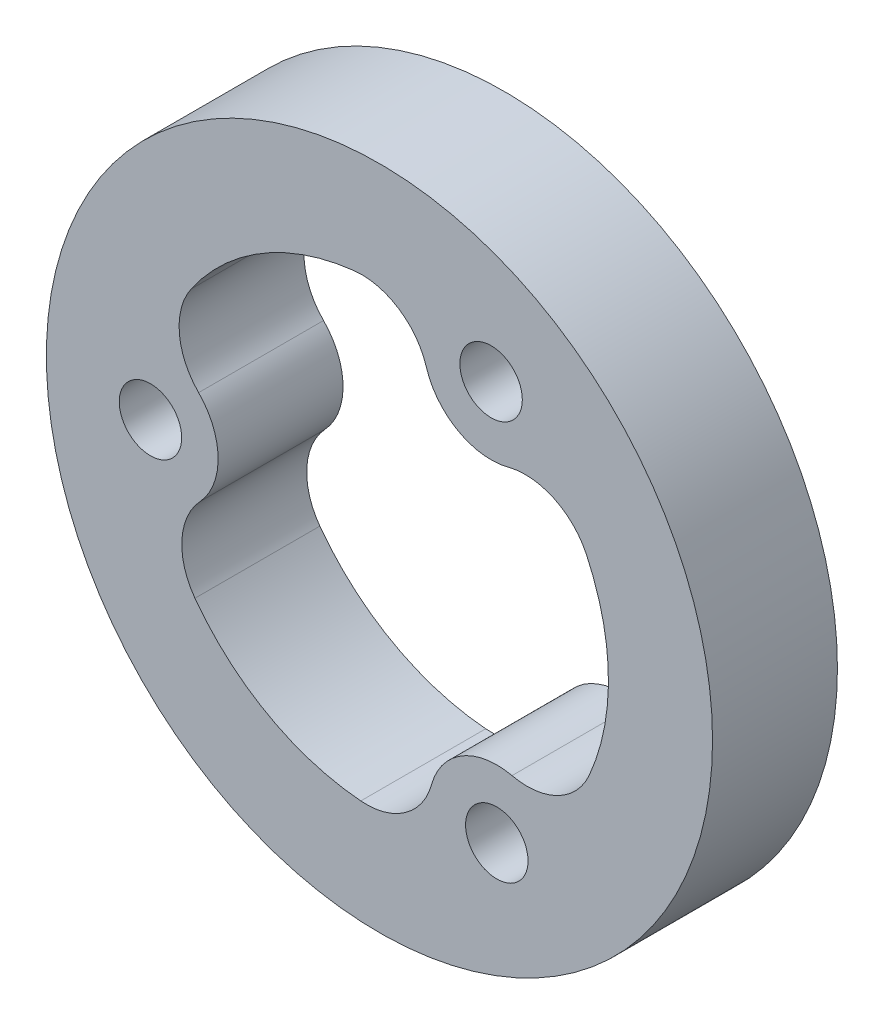
ISO-10303-21;
HEADER;
FILE_DESCRIPTION(('STEP AP214'),'2;1');
FILE_NAME('part.step','',(''),(''),'','','');
FILE_SCHEMA(('AUTOMOTIVE_DESIGN { 1 0 10303 214 1 1 1 1 }'));
ENDSEC;
DATA;
#1=APPLICATION_CONTEXT('core data for automotive mechanical design processes');
#2=APPLICATION_PROTOCOL_DEFINITION('international standard','automotive_design',2000,#1);
#3=PRODUCT_CONTEXT('',#1,'mechanical');
#4=PRODUCT('Part','Part','',(#3));
#5=PRODUCT_RELATED_PRODUCT_CATEGORY('part','',(#4));
#6=PRODUCT_DEFINITION_FORMATION('','',#4);
#7=PRODUCT_DEFINITION_CONTEXT('part definition',#1,'design');
#8=PRODUCT_DEFINITION('design','',#6,#7);
#9=PRODUCT_DEFINITION_SHAPE('','',#8);
#10=(LENGTH_UNIT() NAMED_UNIT(*) SI_UNIT(.MILLI.,.METRE.));
#11=(NAMED_UNIT(*) PLANE_ANGLE_UNIT() SI_UNIT($,.RADIAN.));
#12=(NAMED_UNIT(*) SI_UNIT($,.STERADIAN.) SOLID_ANGLE_UNIT());
#13=UNCERTAINTY_MEASURE_WITH_UNIT(LENGTH_MEASURE(1.E-05),#10,'distance_accuracy_value','');
#14=(GEOMETRIC_REPRESENTATION_CONTEXT(3) GLOBAL_UNCERTAINTY_ASSIGNED_CONTEXT((#13)) GLOBAL_UNIT_ASSIGNED_CONTEXT((#10,
#11,#12)) REPRESENTATION_CONTEXT('',''));
#15=CARTESIAN_POINT('',(0.,0.,0.));
#16=DIRECTION('',(0.,0.,1.));
#17=DIRECTION('',(1.,0.,0.));
#18=AXIS2_PLACEMENT_3D('',#15,#16,#17);
#19=CARTESIAN_POINT('',(0.,0.,6.));
#20=DIRECTION('',(0.,0.,1.));
#21=DIRECTION('',(1.,0.,0.));
#22=AXIS2_PLACEMENT_3D('',#19,#20,#21);
#23=PLANE('',#22);
#24=CARTESIAN_POINT('',(5.36232428206938,9.60445096264857,6.));
#25=DIRECTION('',(0.,0.,1.));
#26=DIRECTION('',(1.,0.,0.));
#27=AXIS2_PLACEMENT_3D('',#24,#25,#26);
#28=CIRCLE('',#27,1.49999999999965);
#29=CARTESIAN_POINT('',(6.86232428206902,9.60445096264857,6.));
#30=VERTEX_POINT('',#29);
#31=EDGE_CURVE('E403',#30,#30,#28,.T.);
#32=ORIENTED_EDGE('',*,*,#31,.F.);
#33=EDGE_LOOP('',(#32));
#34=FACE_BOUND('',#33,.T.);
#35=CARTESIAN_POINT('',(-10.9988606640904,-0.158316429722264,6.));
#36=DIRECTION('',(0.,0.,-1.));
#37=DIRECTION('',(1.,0.,0.));
#38=AXIS2_PLACEMENT_3D('',#35,#36,#37);
#39=CIRCLE('',#38,3.24999999999999);
#40=CARTESIAN_POINT('',(-8.6863165804043,2.12524216619956,6.));
#41=VERTEX_POINT('',#40);
#42=CARTESIAN_POINT('',(-8.6215496453974,-2.37436975047086,6.));
#43=VERTEX_POINT('',#42);
#44=EDGE_CURVE('E130',#41,#43,#39,.T.);
#45=ORIENTED_EDGE('',*,*,#44,.F.);
#46=CARTESIAN_POINT('',(-6.37377249671819,4.40880076212158,6.));
#47=DIRECTION('',(0.,0.,1.));
#48=DIRECTION('',(1.,0.,0.));
#49=AXIS2_PLACEMENT_3D('',#46,#47,#48);
#50=CIRCLE('',#49,3.24999999999926);
#51=CARTESIAN_POINT('',(-9.04664483405021,6.25765269462329,6.));
#52=VERTEX_POINT('',#51);
#53=EDGE_CURVE('E122',#52,#41,#50,.T.);
#54=ORIENTED_EDGE('',*,*,#53,.F.);
#55=CARTESIAN_POINT('',(0.,0.,6.));
#56=DIRECTION('',(0.,0.,1.));
#57=DIRECTION('',(1.,0.,0.));
#58=AXIS2_PLACEMENT_3D('',#55,#56,#57);
#59=CIRCLE('',#58,10.9999999999988);
#60=CARTESIAN_POINT('',(-1.2111407077235,10.9331211548244,6.));
#61=VERTEX_POINT('',#60);
#62=EDGE_CURVE('E164',#61,#52,#59,.T.);
#63=ORIENTED_EDGE('',*,*,#62,.F.);
#64=CARTESIAN_POINT('',(-0.85330368044189,7.70288081362794,6.));
#65=DIRECTION('',(0.,0.,1.));
#66=DIRECTION('',(1.,0.,0.));
#67=AXIS2_PLACEMENT_3D('',#64,#65,#66);
#68=CIRCLE('',#67,3.24999999999908);
#69=CARTESIAN_POINT('',(2.25451030081381,8.65366588813813,6.));
#70=VERTEX_POINT('',#69);
#71=EDGE_CURVE('E162',#70,#61,#68,.T.);
#72=ORIENTED_EDGE('',*,*,#71,.F.);
#73=CARTESIAN_POINT('',(5.36232428206938,9.60445096264857,6.));
#74=DIRECTION('',(0.,0.,-1.));
#75=DIRECTION('',(1.,0.,0.));
#76=AXIS2_PLACEMENT_3D('',#73,#74,#75);
#77=CIRCLE('',#76,3.24999999999991);
#78=CARTESIAN_POINT('',(6.18367199532531,6.45994974084337,6.));
#79=VERTEX_POINT('',#78);
#80=EDGE_CURVE('E160',#79,#70,#77,.T.);
#81=ORIENTED_EDGE('',*,*,#80,.F.);
#82=CARTESIAN_POINT('',(7.00501970858067,3.31544851903942,6.));
#83=DIRECTION('',(0.,0.,1.));
#84=DIRECTION('',(1.,0.,0.));
#85=AXIS2_PLACEMENT_3D('',#82,#83,#84);
#86=CIRCLE('',#85,3.24999999999943);
#87=CARTESIAN_POINT('',(9.94260861862918,4.70579789799105,6.));
#88=VERTEX_POINT('',#87);
#89=EDGE_CURVE('E158',#88,#79,#86,.T.);
#90=ORIENTED_EDGE('',*,*,#89,.F.);
#91=CARTESIAN_POINT('',(0.,0.,6.));
#92=DIRECTION('',(0.,0.,1.));
#93=DIRECTION('',(1.,0.,0.));
#94=AXIS2_PLACEMENT_3D('',#91,#92,#93);
#95=CIRCLE('',#94,10.9999999999989);
#96=CARTESIAN_POINT('',(10.0739310165937,-4.41768195696649,6.));
#97=VERTEX_POINT('',#96);
#98=EDGE_CURVE('E156',#97,#88,#95,.T.);
#99=ORIENTED_EDGE('',*,*,#98,.F.);
#100=CARTESIAN_POINT('',(7.09754230714633,-3.11245774240856,6.));
#101=DIRECTION('',(0.,0.,1.));
#102=DIRECTION('',(1.,0.,0.));
#103=AXIS2_PLACEMENT_3D('',#100,#101,#102);
#104=CIRCLE('',#103,3.24999999999907);
#105=CARTESIAN_POINT('',(6.36703934458366,-6.27929613766765,6.));
#106=VERTEX_POINT('',#105);
#107=EDGE_CURVE('E154',#106,#97,#104,.T.);
#108=ORIENTED_EDGE('',*,*,#107,.F.);
#109=CARTESIAN_POINT('',(5.636536382021,-9.44613453292673,6.));
#110=DIRECTION('',(0.,0.,-1.));
#111=DIRECTION('',(1.,0.,0.));
#112=AXIS2_PLACEMENT_3D('',#109,#110,#111);
#113=CIRCLE('',#112,3.24999999999999);
#114=CARTESIAN_POINT('',(2.50264458507853,-8.58519190704386,6.));
#115=VERTEX_POINT('',#114);
#116=EDGE_CURVE('E152',#115,#106,#113,.T.);
#117=ORIENTED_EDGE('',*,*,#116,.F.);
#118=CARTESIAN_POINT('',(-0.631247211862512,-7.72424928116139,6.));
#119=DIRECTION('',(0.,0.,1.));
#120=DIRECTION('',(1.,0.,0.));
#121=AXIS2_PLACEMENT_3D('',#118,#119,#120);
#122=CIRCLE('',#121,3.24999999999935);
#123=CARTESIAN_POINT('',(-0.895963784578909,-10.9634505926145,6.));
#124=VERTEX_POINT('',#123);
#125=EDGE_CURVE('E150',#124,#115,#122,.T.);
#126=ORIENTED_EDGE('',*,*,#125,.F.);
#127=CARTESIAN_POINT('',(0.,0.,6.));
#128=DIRECTION('',(0.,0.,1.));
#129=DIRECTION('',(1.,0.,0.));
#130=AXIS2_PLACEMENT_3D('',#127,#128,#129);
#131=CIRCLE('',#130,10.9999999999989);
#132=CARTESIAN_POINT('',(-8.86279030886989,-6.51543919785902,6.));
#133=VERTEX_POINT('',#132);
#134=EDGE_CURVE('E145',#133,#124,#131,.T.);
#135=ORIENTED_EDGE('',*,*,#134,.F.);
#136=CARTESIAN_POINT('',(-6.24423862670442,-4.59042307121947,6.));
#137=DIRECTION('',(0.,0.,1.));
#138=DIRECTION('',(1.,0.,0.));
#139=AXIS2_PLACEMENT_3D('',#136,#137,#138);
#140=CIRCLE('',#139,3.24999999999907);
#141=EDGE_CURVE('E143',#43,#133,#140,.T.);
#142=ORIENTED_EDGE('',*,*,#141,.F.);
#143=EDGE_LOOP('',(#45,#54,#63,#72,#81,#90,#99,#108,#117,#126,#135,#142));
#144=FACE_BOUND('',#143,.T.);
#145=CARTESIAN_POINT('',(0.,0.,6.));
#146=DIRECTION('',(0.,0.,1.));
#147=DIRECTION('',(1.,0.,0.));
#148=AXIS2_PLACEMENT_3D('',#145,#146,#147);
#149=CIRCLE('',#148,16.);
#150=CARTESIAN_POINT('',(16.,0.,6.));
#151=VERTEX_POINT('',#150);
#152=EDGE_CURVE('E11',#151,#151,#149,.T.);
#153=ORIENTED_EDGE('',*,*,#152,.T.);
#154=EDGE_LOOP('',(#153));
#155=FACE_BOUND('',#154,.T.);
#156=CARTESIAN_POINT('',(-10.9988606640904,-0.158316429722264,6.));
#157=DIRECTION('',(0.,0.,1.));
#158=DIRECTION('',(1.,0.,0.));
#159=AXIS2_PLACEMENT_3D('',#156,#157,#158);
#160=CIRCLE('',#159,1.49999999999981);
#161=CARTESIAN_POINT('',(-9.49886066409057,-0.158316429722264,6.));
#162=VERTEX_POINT('',#161);
#163=EDGE_CURVE('E167',#162,#162,#160,.T.);
#164=ORIENTED_EDGE('',*,*,#163,.F.);
#165=EDGE_LOOP('',(#164));
#166=FACE_BOUND('',#165,.T.);
#167=CARTESIAN_POINT('',(5.636536382021,-9.44613453292673,6.));
#168=DIRECTION('',(0.,0.,1.));
#169=DIRECTION('',(1.,0.,0.));
#170=AXIS2_PLACEMENT_3D('',#167,#168,#169);
#171=CIRCLE('',#170,1.49999999999988);
#172=CARTESIAN_POINT('',(7.13653638202088,-9.44613453292673,6.));
#173=VERTEX_POINT('',#172);
#174=EDGE_CURVE('E394',#173,#173,#171,.T.);
#175=ORIENTED_EDGE('',*,*,#174,.F.);
#176=EDGE_LOOP('',(#175));
#177=FACE_BOUND('',#176,.T.);
#178=ADVANCED_FACE('F33',(#34,#144,#155,#166,#177),#23,.T.);
#179=CARTESIAN_POINT('',(0.,0.,0.));
#180=DIRECTION('',(0.,0.,1.));
#181=DIRECTION('',(1.,0.,0.));
#182=AXIS2_PLACEMENT_3D('',#179,#180,#181);
#183=PLANE('',#182);
#184=CARTESIAN_POINT('',(0.,0.,0.));
#185=DIRECTION('',(0.,0.,1.));
#186=DIRECTION('',(1.,0.,0.));
#187=AXIS2_PLACEMENT_3D('',#184,#185,#186);
#188=CIRCLE('',#187,16.);
#189=CARTESIAN_POINT('',(16.,0.,0.));
#190=VERTEX_POINT('',#189);
#191=EDGE_CURVE('E37',#190,#190,#188,.T.);
#192=ORIENTED_EDGE('',*,*,#191,.F.);
#193=EDGE_LOOP('',(#192));
#194=FACE_BOUND('',#193,.T.);
#195=CARTESIAN_POINT('',(-6.37377249671819,4.40880076212158,0.));
#196=DIRECTION('',(0.,0.,1.));
#197=DIRECTION('',(1.,0.,0.));
#198=AXIS2_PLACEMENT_3D('',#195,#196,#197);
#199=CIRCLE('',#198,3.24999999999926);
#200=CARTESIAN_POINT('',(-9.04664483405021,6.25765269462329,0.));
#201=VERTEX_POINT('',#200);
#202=CARTESIAN_POINT('',(-8.6863165804043,2.12524216619956,0.));
#203=VERTEX_POINT('',#202);
#204=EDGE_CURVE('E56',#201,#203,#199,.T.);
#205=ORIENTED_EDGE('',*,*,#204,.T.);
#206=CARTESIAN_POINT('',(-10.9988606640904,-0.158316429722264,0.));
#207=DIRECTION('',(0.,0.,-1.));
#208=DIRECTION('',(1.,0.,0.));
#209=AXIS2_PLACEMENT_3D('',#206,#207,#208);
#210=CIRCLE('',#209,3.24999999999999);
#211=CARTESIAN_POINT('',(-8.6215496453974,-2.37436975047086,0.));
#212=VERTEX_POINT('',#211);
#213=EDGE_CURVE('E137',#203,#212,#210,.T.);
#214=ORIENTED_EDGE('',*,*,#213,.T.);
#215=CARTESIAN_POINT('',(-6.24423862670442,-4.59042307121947,0.));
#216=DIRECTION('',(0.,0.,1.));
#217=DIRECTION('',(1.,0.,0.));
#218=AXIS2_PLACEMENT_3D('',#215,#216,#217);
#219=CIRCLE('',#218,3.24999999999907);
#220=CARTESIAN_POINT('',(-8.86279030886989,-6.51543919785902,0.));
#221=VERTEX_POINT('',#220);
#222=EDGE_CURVE('E169',#212,#221,#219,.T.);
#223=ORIENTED_EDGE('',*,*,#222,.T.);
#224=CARTESIAN_POINT('',(0.,0.,0.));
#225=DIRECTION('',(0.,0.,1.));
#226=DIRECTION('',(1.,0.,0.));
#227=AXIS2_PLACEMENT_3D('',#224,#225,#226);
#228=CIRCLE('',#227,10.9999999999989);
#229=CARTESIAN_POINT('',(-0.895963784578909,-10.9634505926145,0.));
#230=VERTEX_POINT('',#229);
#231=EDGE_CURVE('E172',#221,#230,#228,.T.);
#232=ORIENTED_EDGE('',*,*,#231,.T.);
#233=CARTESIAN_POINT('',(-0.631247211862512,-7.72424928116139,0.));
#234=DIRECTION('',(0.,0.,1.));
#235=DIRECTION('',(1.,0.,0.));
#236=AXIS2_PLACEMENT_3D('',#233,#234,#235);
#237=CIRCLE('',#236,3.24999999999935);
#238=CARTESIAN_POINT('',(2.50264458507853,-8.58519190704386,0.));
#239=VERTEX_POINT('',#238);
#240=EDGE_CURVE('E175',#230,#239,#237,.T.);
#241=ORIENTED_EDGE('',*,*,#240,.T.);
#242=CARTESIAN_POINT('',(5.636536382021,-9.44613453292673,0.));
#243=DIRECTION('',(0.,0.,-1.));
#244=DIRECTION('',(1.,0.,0.));
#245=AXIS2_PLACEMENT_3D('',#242,#243,#244);
#246=CIRCLE('',#245,3.24999999999999);
#247=CARTESIAN_POINT('',(6.36703934458366,-6.27929613766765,0.));
#248=VERTEX_POINT('',#247);
#249=EDGE_CURVE('E178',#239,#248,#246,.T.);
#250=ORIENTED_EDGE('',*,*,#249,.T.);
#251=CARTESIAN_POINT('',(7.09754230714633,-3.11245774240856,0.));
#252=DIRECTION('',(0.,0.,1.));
#253=DIRECTION('',(1.,0.,0.));
#254=AXIS2_PLACEMENT_3D('',#251,#252,#253);
#255=CIRCLE('',#254,3.24999999999907);
#256=CARTESIAN_POINT('',(10.0739310165937,-4.41768195696649,0.));
#257=VERTEX_POINT('',#256);
#258=EDGE_CURVE('E181',#248,#257,#255,.T.);
#259=ORIENTED_EDGE('',*,*,#258,.T.);
#260=CARTESIAN_POINT('',(0.,0.,0.));
#261=DIRECTION('',(0.,0.,1.));
#262=DIRECTION('',(1.,0.,0.));
#263=AXIS2_PLACEMENT_3D('',#260,#261,#262);
#264=CIRCLE('',#263,10.9999999999989);
#265=CARTESIAN_POINT('',(9.94260861862918,4.70579789799105,0.));
#266=VERTEX_POINT('',#265);
#267=EDGE_CURVE('E184',#257,#266,#264,.T.);
#268=ORIENTED_EDGE('',*,*,#267,.T.);
#269=CARTESIAN_POINT('',(7.00501970858067,3.31544851903942,0.));
#270=DIRECTION('',(0.,0.,1.));
#271=DIRECTION('',(1.,0.,0.));
#272=AXIS2_PLACEMENT_3D('',#269,#270,#271);
#273=CIRCLE('',#272,3.24999999999943);
#274=CARTESIAN_POINT('',(6.18367199532531,6.45994974084337,0.));
#275=VERTEX_POINT('',#274);
#276=EDGE_CURVE('E187',#266,#275,#273,.T.);
#277=ORIENTED_EDGE('',*,*,#276,.T.);
#278=CARTESIAN_POINT('',(5.36232428206938,9.60445096264857,0.));
#279=DIRECTION('',(0.,0.,-1.));
#280=DIRECTION('',(1.,0.,0.));
#281=AXIS2_PLACEMENT_3D('',#278,#279,#280);
#282=CIRCLE('',#281,3.24999999999991);
#283=CARTESIAN_POINT('',(2.25451030081381,8.65366588813813,0.));
#284=VERTEX_POINT('',#283);
#285=EDGE_CURVE('E190',#275,#284,#282,.T.);
#286=ORIENTED_EDGE('',*,*,#285,.T.);
#287=CARTESIAN_POINT('',(-0.85330368044189,7.70288081362794,0.));
#288=DIRECTION('',(0.,0.,1.));
#289=DIRECTION('',(1.,0.,0.));
#290=AXIS2_PLACEMENT_3D('',#287,#288,#289);
#291=CIRCLE('',#290,3.24999999999908);
#292=CARTESIAN_POINT('',(-1.21114070772362,10.9331211548255,0.));
#293=VERTEX_POINT('',#292);
#294=EDGE_CURVE('E193',#284,#293,#291,.T.);
#295=ORIENTED_EDGE('',*,*,#294,.T.);
#296=CARTESIAN_POINT('',(0.,0.,0.));
#297=DIRECTION('',(0.,0.,1.));
#298=DIRECTION('',(1.,0.,0.));
#299=AXIS2_PLACEMENT_3D('',#296,#297,#298);
#300=CIRCLE('',#299,10.9999999999988);
#301=EDGE_CURVE('E131',#293,#201,#300,.T.);
#302=ORIENTED_EDGE('',*,*,#301,.T.);
#303=EDGE_LOOP('',(#205,#214,#223,#232,#241,#250,#259,#268,#277,#286,#295,#302));
#304=FACE_BOUND('',#303,.T.);
#305=CARTESIAN_POINT('',(-10.9988606640904,-0.158316429722264,0.));
#306=DIRECTION('',(0.,0.,1.));
#307=DIRECTION('',(1.,0.,0.));
#308=AXIS2_PLACEMENT_3D('',#305,#306,#307);
#309=CIRCLE('',#308,1.49999999999981);
#310=CARTESIAN_POINT('',(-9.49886066409057,-0.158316429722264,0.));
#311=VERTEX_POINT('',#310);
#312=EDGE_CURVE('E406',#311,#311,#309,.T.);
#313=ORIENTED_EDGE('',*,*,#312,.T.);
#314=EDGE_LOOP('',(#313));
#315=FACE_BOUND('',#314,.T.);
#316=CARTESIAN_POINT('',(5.36232428206938,9.60445096264857,0.));
#317=DIRECTION('',(0.,0.,1.));
#318=DIRECTION('',(1.,0.,0.));
#319=AXIS2_PLACEMENT_3D('',#316,#317,#318);
#320=CIRCLE('',#319,1.49999999999965);
#321=CARTESIAN_POINT('',(6.86232428206902,9.60445096264857,0.));
#322=VERTEX_POINT('',#321);
#323=EDGE_CURVE('E400',#322,#322,#320,.T.);
#324=ORIENTED_EDGE('',*,*,#323,.T.);
#325=EDGE_LOOP('',(#324));
#326=FACE_BOUND('',#325,.T.);
#327=CARTESIAN_POINT('',(5.636536382021,-9.44613453292673,0.));
#328=DIRECTION('',(0.,0.,1.));
#329=DIRECTION('',(1.,0.,0.));
#330=AXIS2_PLACEMENT_3D('',#327,#328,#329);
#331=CIRCLE('',#330,1.49999999999988);
#332=CARTESIAN_POINT('',(7.13653638202088,-9.44613453292673,0.));
#333=VERTEX_POINT('',#332);
#334=EDGE_CURVE('E397',#333,#333,#331,.T.);
#335=ORIENTED_EDGE('',*,*,#334,.T.);
#336=EDGE_LOOP('',(#335));
#337=FACE_BOUND('',#336,.T.);
#338=ADVANCED_FACE('F222',(#194,#304,#315,#326,#337),#183,.F.);
#339=CARTESIAN_POINT('',(0.,0.,6.));
#340=DIRECTION('',(0.,0.,-1.));
#341=DIRECTION('',(-1.,0.,0.));
#342=AXIS2_PLACEMENT_3D('',#339,#340,#341);
#343=CYLINDRICAL_SURFACE('',#342,16.);
#344=ORIENTED_EDGE('',*,*,#152,.F.);
#345=EDGE_LOOP('',(#344));
#346=FACE_BOUND('',#345,.T.);
#347=ORIENTED_EDGE('',*,*,#191,.T.);
#348=EDGE_LOOP('',(#347));
#349=FACE_BOUND('',#348,.T.);
#350=ADVANCED_FACE('F35',(#346,#349),#343,.T.);
#351=CARTESIAN_POINT('',(-6.37377249671819,4.40880076212158,6.));
#352=DIRECTION('',(0.,0.,-1.));
#353=DIRECTION('',(-1.,0.,0.));
#354=AXIS2_PLACEMENT_3D('',#351,#352,#353);
#355=CYLINDRICAL_SURFACE('',#354,3.24999999999926);
#356=ORIENTED_EDGE('',*,*,#204,.F.);
#357=DIRECTION('',(0.,0.,-1.));
#358=VECTOR('',#357,1.);
#359=CARTESIAN_POINT('',(-9.04664483405021,6.25765269462329,6.));
#360=LINE('',#359,#358);
#361=EDGE_CURVE('E126',#52,#201,#360,.T.);
#362=ORIENTED_EDGE('',*,*,#361,.F.);
#363=ORIENTED_EDGE('',*,*,#53,.T.);
#364=DIRECTION('',(0.,0.,-1.));
#365=VECTOR('',#364,1.);
#366=CARTESIAN_POINT('',(-8.6863165804043,2.12524216619956,6.));
#367=LINE('',#366,#365);
#368=EDGE_CURVE('E125',#41,#203,#367,.T.);
#369=ORIENTED_EDGE('',*,*,#368,.T.);
#370=EDGE_LOOP('',(#356,#362,#363,#369));
#371=FACE_BOUND('',#370,.T.);
#372=ADVANCED_FACE('F124',(#371),#355,.F.);
#373=CARTESIAN_POINT('',(-10.9988606640904,-0.158316429722264,6.));
#374=DIRECTION('',(0.,0.,-1.));
#375=DIRECTION('',(-1.,0.,0.));
#376=AXIS2_PLACEMENT_3D('',#373,#374,#375);
#377=CYLINDRICAL_SURFACE('',#376,3.24999999999999);
#378=ORIENTED_EDGE('',*,*,#213,.F.);
#379=ORIENTED_EDGE('',*,*,#368,.F.);
#380=ORIENTED_EDGE('',*,*,#44,.T.);
#381=DIRECTION('',(0.,0.,-1.));
#382=VECTOR('',#381,1.);
#383=CARTESIAN_POINT('',(-8.6215496453974,-2.37436975047086,6.));
#384=LINE('',#383,#382);
#385=EDGE_CURVE('E138',#43,#212,#384,.T.);
#386=ORIENTED_EDGE('',*,*,#385,.T.);
#387=EDGE_LOOP('',(#378,#379,#380,#386));
#388=FACE_BOUND('',#387,.T.);
#389=ADVANCED_FACE('F134',(#388),#377,.T.);
#390=CARTESIAN_POINT('',(-6.24423862670442,-4.59042307121947,6.));
#391=DIRECTION('',(0.,0.,-1.));
#392=DIRECTION('',(-1.,0.,0.));
#393=AXIS2_PLACEMENT_3D('',#390,#391,#392);
#394=CYLINDRICAL_SURFACE('',#393,3.24999999999907);
#395=ORIENTED_EDGE('',*,*,#222,.F.);
#396=ORIENTED_EDGE('',*,*,#385,.F.);
#397=ORIENTED_EDGE('',*,*,#141,.T.);
#398=DIRECTION('',(0.,0.,-1.));
#399=VECTOR('',#398,1.);
#400=CARTESIAN_POINT('',(-8.86279030886989,-6.51543919785902,6.));
#401=LINE('',#400,#399);
#402=EDGE_CURVE('E214',#133,#221,#401,.T.);
#403=ORIENTED_EDGE('',*,*,#402,.T.);
#404=EDGE_LOOP('',(#395,#396,#397,#403));
#405=FACE_BOUND('',#404,.T.);
#406=ADVANCED_FACE('F218',(#405),#394,.F.);
#407=CARTESIAN_POINT('',(0.,0.,6.));
#408=DIRECTION('',(0.,0.,-1.));
#409=DIRECTION('',(-1.,0.,0.));
#410=AXIS2_PLACEMENT_3D('',#407,#408,#409);
#411=CYLINDRICAL_SURFACE('',#410,10.9999999999989);
#412=ORIENTED_EDGE('',*,*,#231,.F.);
#413=ORIENTED_EDGE('',*,*,#402,.F.);
#414=ORIENTED_EDGE('',*,*,#134,.T.);
#415=DIRECTION('',(0.,0.,-1.));
#416=VECTOR('',#415,1.);
#417=CARTESIAN_POINT('',(-0.895963784578909,-10.9634505926145,6.));
#418=LINE('',#417,#416);
#419=EDGE_CURVE('E212',#124,#230,#418,.T.);
#420=ORIENTED_EDGE('',*,*,#419,.T.);
#421=EDGE_LOOP('',(#412,#413,#414,#420));
#422=FACE_BOUND('',#421,.T.);
#423=ADVANCED_FACE('F261',(#422),#411,.F.);
#424=CARTESIAN_POINT('',(-0.631247211862512,-7.72424928116139,6.));
#425=DIRECTION('',(0.,0.,-1.));
#426=DIRECTION('',(-1.,0.,0.));
#427=AXIS2_PLACEMENT_3D('',#424,#425,#426);
#428=CYLINDRICAL_SURFACE('',#427,3.24999999999935);
#429=ORIENTED_EDGE('',*,*,#240,.F.);
#430=ORIENTED_EDGE('',*,*,#419,.F.);
#431=ORIENTED_EDGE('',*,*,#125,.T.);
#432=DIRECTION('',(0.,0.,-1.));
#433=VECTOR('',#432,1.);
#434=CARTESIAN_POINT('',(2.50264458507853,-8.58519190704386,6.));
#435=LINE('',#434,#433);
#436=EDGE_CURVE('E210',#115,#239,#435,.T.);
#437=ORIENTED_EDGE('',*,*,#436,.T.);
#438=EDGE_LOOP('',(#429,#430,#431,#437));
#439=FACE_BOUND('',#438,.T.);
#440=ADVANCED_FACE('F259',(#439),#428,.F.);
#441=CARTESIAN_POINT('',(5.636536382021,-9.44613453292673,6.));
#442=DIRECTION('',(0.,0.,-1.));
#443=DIRECTION('',(-1.,0.,0.));
#444=AXIS2_PLACEMENT_3D('',#441,#442,#443);
#445=CYLINDRICAL_SURFACE('',#444,3.24999999999999);
#446=ORIENTED_EDGE('',*,*,#249,.F.);
#447=ORIENTED_EDGE('',*,*,#436,.F.);
#448=ORIENTED_EDGE('',*,*,#116,.T.);
#449=DIRECTION('',(0.,0.,-1.));
#450=VECTOR('',#449,1.);
#451=CARTESIAN_POINT('',(6.36703934458366,-6.27929613766765,6.));
#452=LINE('',#451,#450);
#453=EDGE_CURVE('E208',#106,#248,#452,.T.);
#454=ORIENTED_EDGE('',*,*,#453,.T.);
#455=EDGE_LOOP('',(#446,#447,#448,#454));
#456=FACE_BOUND('',#455,.T.);
#457=ADVANCED_FACE('F253',(#456),#445,.T.);
#458=CARTESIAN_POINT('',(7.09754230714633,-3.11245774240856,6.));
#459=DIRECTION('',(0.,0.,-1.));
#460=DIRECTION('',(-1.,0.,0.));
#461=AXIS2_PLACEMENT_3D('',#458,#459,#460);
#462=CYLINDRICAL_SURFACE('',#461,3.24999999999907);
#463=ORIENTED_EDGE('',*,*,#258,.F.);
#464=ORIENTED_EDGE('',*,*,#453,.F.);
#465=ORIENTED_EDGE('',*,*,#107,.T.);
#466=DIRECTION('',(0.,0.,-1.));
#467=VECTOR('',#466,1.);
#468=CARTESIAN_POINT('',(10.0739310165937,-4.41768195696649,6.));
#469=LINE('',#468,#467);
#470=EDGE_CURVE('E206',#97,#257,#469,.T.);
#471=ORIENTED_EDGE('',*,*,#470,.T.);
#472=EDGE_LOOP('',(#463,#464,#465,#471));
#473=FACE_BOUND('',#472,.T.);
#474=ADVANCED_FACE('F249',(#473),#462,.F.);
#475=CARTESIAN_POINT('',(0.,0.,6.));
#476=DIRECTION('',(0.,0.,-1.));
#477=DIRECTION('',(-1.,0.,0.));
#478=AXIS2_PLACEMENT_3D('',#475,#476,#477);
#479=CYLINDRICAL_SURFACE('',#478,10.9999999999989);
#480=ORIENTED_EDGE('',*,*,#267,.F.);
#481=ORIENTED_EDGE('',*,*,#470,.F.);
#482=ORIENTED_EDGE('',*,*,#98,.T.);
#483=DIRECTION('',(0.,0.,-1.));
#484=VECTOR('',#483,1.);
#485=CARTESIAN_POINT('',(9.94260861862918,4.70579789799105,6.));
#486=LINE('',#485,#484);
#487=EDGE_CURVE('E204',#88,#266,#486,.T.);
#488=ORIENTED_EDGE('',*,*,#487,.T.);
#489=EDGE_LOOP('',(#480,#481,#482,#488));
#490=FACE_BOUND('',#489,.T.);
#491=ADVANCED_FACE('F246',(#490),#479,.F.);
#492=CARTESIAN_POINT('',(7.00501970858067,3.31544851903942,6.));
#493=DIRECTION('',(0.,0.,-1.));
#494=DIRECTION('',(-1.,0.,0.));
#495=AXIS2_PLACEMENT_3D('',#492,#493,#494);
#496=CYLINDRICAL_SURFACE('',#495,3.24999999999943);
#497=ORIENTED_EDGE('',*,*,#276,.F.);
#498=ORIENTED_EDGE('',*,*,#487,.F.);
#499=ORIENTED_EDGE('',*,*,#89,.T.);
#500=DIRECTION('',(0.,0.,-1.));
#501=VECTOR('',#500,1.);
#502=CARTESIAN_POINT('',(6.18367199532531,6.45994974084337,6.));
#503=LINE('',#502,#501);
#504=EDGE_CURVE('E202',#79,#275,#503,.T.);
#505=ORIENTED_EDGE('',*,*,#504,.T.);
#506=EDGE_LOOP('',(#497,#498,#499,#505));
#507=FACE_BOUND('',#506,.T.);
#508=ADVANCED_FACE('F238',(#507),#496,.F.);
#509=CARTESIAN_POINT('',(5.36232428206938,9.60445096264857,6.));
#510=DIRECTION('',(0.,0.,-1.));
#511=DIRECTION('',(-1.,0.,0.));
#512=AXIS2_PLACEMENT_3D('',#509,#510,#511);
#513=CYLINDRICAL_SURFACE('',#512,3.24999999999991);
#514=ORIENTED_EDGE('',*,*,#285,.F.);
#515=ORIENTED_EDGE('',*,*,#504,.F.);
#516=ORIENTED_EDGE('',*,*,#80,.T.);
#517=DIRECTION('',(0.,0.,-1.));
#518=VECTOR('',#517,1.);
#519=CARTESIAN_POINT('',(2.25451030081381,8.65366588813813,6.));
#520=LINE('',#519,#518);
#521=EDGE_CURVE('E200',#70,#284,#520,.T.);
#522=ORIENTED_EDGE('',*,*,#521,.T.);
#523=EDGE_LOOP('',(#514,#515,#516,#522));
#524=FACE_BOUND('',#523,.T.);
#525=ADVANCED_FACE('F234',(#524),#513,.T.);
#526=CARTESIAN_POINT('',(-0.85330368044189,7.70288081362794,6.));
#527=DIRECTION('',(0.,0.,-1.));
#528=DIRECTION('',(-1.,0.,0.));
#529=AXIS2_PLACEMENT_3D('',#526,#527,#528);
#530=CYLINDRICAL_SURFACE('',#529,3.24999999999908);
#531=ORIENTED_EDGE('',*,*,#294,.F.);
#532=ORIENTED_EDGE('',*,*,#521,.F.);
#533=ORIENTED_EDGE('',*,*,#71,.T.);
#534=DIRECTION('',(0.,0.,-1.));
#535=VECTOR('',#534,1.);
#536=CARTESIAN_POINT('',(-1.21114070772362,10.9331211548255,6.));
#537=LINE('',#536,#535);
#538=EDGE_CURVE('E48',#61,#293,#537,.T.);
#539=ORIENTED_EDGE('',*,*,#538,.T.);
#540=EDGE_LOOP('',(#531,#532,#533,#539));
#541=FACE_BOUND('',#540,.T.);
#542=ADVANCED_FACE('F231',(#541),#530,.F.);
#543=CARTESIAN_POINT('',(0.,0.,6.));
#544=DIRECTION('',(0.,0.,-1.));
#545=DIRECTION('',(-1.,0.,0.));
#546=AXIS2_PLACEMENT_3D('',#543,#544,#545);
#547=CYLINDRICAL_SURFACE('',#546,10.9999999999988);
#548=ORIENTED_EDGE('',*,*,#301,.F.);
#549=ORIENTED_EDGE('',*,*,#538,.F.);
#550=ORIENTED_EDGE('',*,*,#62,.T.);
#551=ORIENTED_EDGE('',*,*,#361,.T.);
#552=EDGE_LOOP('',(#548,#549,#550,#551));
#553=FACE_BOUND('',#552,.T.);
#554=ADVANCED_FACE('F225',(#553),#547,.F.);
#555=CARTESIAN_POINT('',(-10.9988606640904,-0.158316429722264,6.));
#556=DIRECTION('',(0.,0.,-1.));
#557=DIRECTION('',(-1.,0.,0.));
#558=AXIS2_PLACEMENT_3D('',#555,#556,#557);
#559=CYLINDRICAL_SURFACE('',#558,1.49999999999981);
#560=ORIENTED_EDGE('',*,*,#163,.T.);
#561=EDGE_LOOP('',(#560));
#562=FACE_BOUND('',#561,.T.);
#563=ORIENTED_EDGE('',*,*,#312,.F.);
#564=EDGE_LOOP('',(#563));
#565=FACE_BOUND('',#564,.T.);
#566=ADVANCED_FACE('F358',(#562,#565),#559,.F.);
#567=CARTESIAN_POINT('',(5.36232428206938,9.60445096264857,6.));
#568=DIRECTION('',(0.,0.,-1.));
#569=DIRECTION('',(-1.,0.,0.));
#570=AXIS2_PLACEMENT_3D('',#567,#568,#569);
#571=CYLINDRICAL_SURFACE('',#570,1.49999999999965);
#572=ORIENTED_EDGE('',*,*,#31,.T.);
#573=EDGE_LOOP('',(#572));
#574=FACE_BOUND('',#573,.T.);
#575=ORIENTED_EDGE('',*,*,#323,.F.);
#576=EDGE_LOOP('',(#575));
#577=FACE_BOUND('',#576,.T.);
#578=ADVANCED_FACE('F367',(#574,#577),#571,.F.);
#579=CARTESIAN_POINT('',(5.636536382021,-9.44613453292673,6.));
#580=DIRECTION('',(0.,0.,-1.));
#581=DIRECTION('',(-1.,0.,0.));
#582=AXIS2_PLACEMENT_3D('',#579,#580,#581);
#583=CYLINDRICAL_SURFACE('',#582,1.49999999999988);
#584=ORIENTED_EDGE('',*,*,#174,.T.);
#585=EDGE_LOOP('',(#584));
#586=FACE_BOUND('',#585,.T.);
#587=ORIENTED_EDGE('',*,*,#334,.F.);
#588=EDGE_LOOP('',(#587));
#589=FACE_BOUND('',#588,.T.);
#590=ADVANCED_FACE('F377',(#586,#589),#583,.F.);
#591=CLOSED_SHELL('',(#178,#338,#350,#372,#389,#406,#423,#440,#457,#474,#491,#508,#525,#542,
#554,#566,#578,#590));
#592=MANIFOLD_SOLID_BREP('B2',#591);
#593=ADVANCED_BREP_SHAPE_REPRESENTATION('',(#18,#592),#14);
#594=SHAPE_DEFINITION_REPRESENTATION(#9,#593);
ENDSEC;
END-ISO-10303-21;
